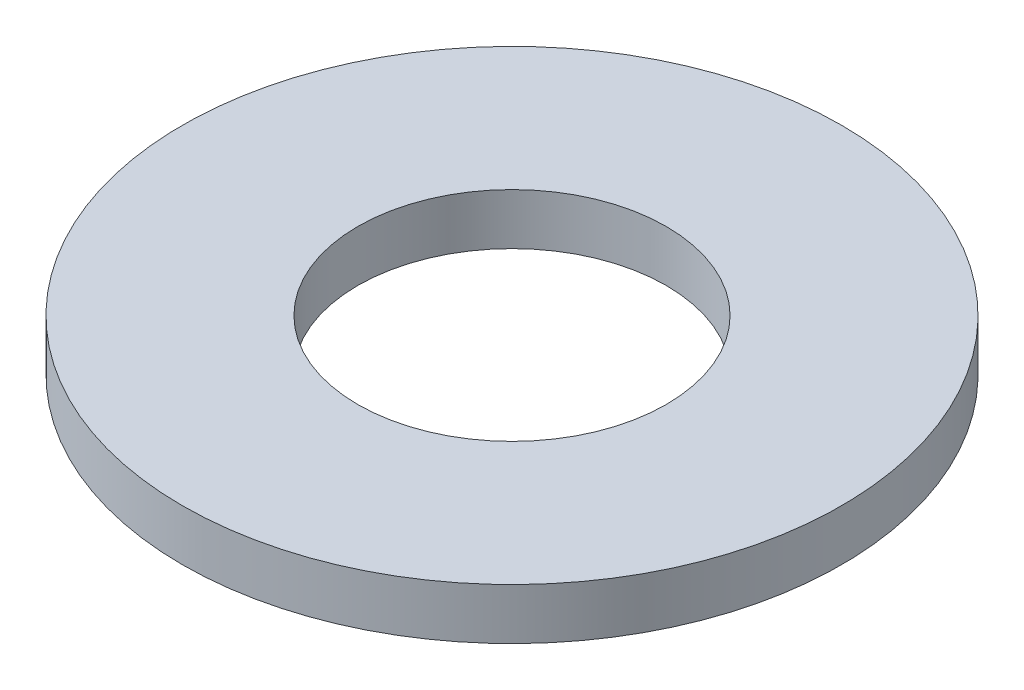
ISO-10303-21;
HEADER;
FILE_DESCRIPTION(('STEP AP214'),'2;1');
FILE_NAME('part.step','',(''),(''),'','','');
FILE_SCHEMA(('AUTOMOTIVE_DESIGN { 1 0 10303 214 1 1 1 1 }'));
ENDSEC;
DATA;
#1=APPLICATION_CONTEXT('core data for automotive mechanical design processes');
#2=APPLICATION_PROTOCOL_DEFINITION('international standard','automotive_design',2000,#1);
#3=PRODUCT_CONTEXT('',#1,'mechanical');
#4=PRODUCT('Part','Part','',(#3));
#5=PRODUCT_RELATED_PRODUCT_CATEGORY('part','',(#4));
#6=PRODUCT_DEFINITION_FORMATION('','',#4);
#7=PRODUCT_DEFINITION_CONTEXT('part definition',#1,'design');
#8=PRODUCT_DEFINITION('design','',#6,#7);
#9=PRODUCT_DEFINITION_SHAPE('','',#8);
#10=(LENGTH_UNIT() NAMED_UNIT(*) SI_UNIT(.MILLI.,.METRE.));
#11=(NAMED_UNIT(*) PLANE_ANGLE_UNIT() SI_UNIT($,.RADIAN.));
#12=(NAMED_UNIT(*) SI_UNIT($,.STERADIAN.) SOLID_ANGLE_UNIT());
#13=UNCERTAINTY_MEASURE_WITH_UNIT(LENGTH_MEASURE(1.E-05),#10,'distance_accuracy_value','');
#14=(GEOMETRIC_REPRESENTATION_CONTEXT(3) GLOBAL_UNCERTAINTY_ASSIGNED_CONTEXT((#13)) GLOBAL_UNIT_ASSIGNED_CONTEXT((#10,
#11,#12)) REPRESENTATION_CONTEXT('',''));
#15=CARTESIAN_POINT('',(0.,0.,0.));
#16=DIRECTION('',(0.,0.,1.));
#17=DIRECTION('',(1.,0.,0.));
#18=AXIS2_PLACEMENT_3D('',#15,#16,#17);
#19=CARTESIAN_POINT('',(0.,0.,0.));
#20=DIRECTION('',(0.,1.,0.));
#21=DIRECTION('',(0.,0.,1.));
#22=AXIS2_PLACEMENT_3D('',#19,#20,#21);
#23=PLANE('',#22);
#24=CARTESIAN_POINT('',(0.,0.,0.));
#25=DIRECTION('',(0.,-1.,0.));
#26=DIRECTION('',(0.,0.,-1.));
#27=AXIS2_PLACEMENT_3D('',#24,#25,#26);
#28=CIRCLE('',#27,4.826);
#29=CARTESIAN_POINT('',(0.,0.,-4.826));
#30=VERTEX_POINT('',#29);
#31=EDGE_CURVE('E27',#30,#30,#28,.F.);
#32=ORIENTED_EDGE('',*,*,#31,.T.);
#33=EDGE_LOOP('',(#32));
#34=FACE_BOUND('',#33,.T.);
#35=CARTESIAN_POINT('',(0.,0.,0.));
#36=DIRECTION('',(0.,-1.,0.));
#37=DIRECTION('',(0.,0.,-1.));
#38=AXIS2_PLACEMENT_3D('',#35,#36,#37);
#39=CIRCLE('',#38,10.3124);
#40=CARTESIAN_POINT('',(0.,0.,-10.3124));
#41=VERTEX_POINT('',#40);
#42=EDGE_CURVE('E18',#41,#41,#39,.F.);
#43=ORIENTED_EDGE('',*,*,#42,.F.);
#44=EDGE_LOOP('',(#43));
#45=FACE_BOUND('',#44,.T.);
#46=ADVANCED_FACE('F15',(#34,#45),#23,.F.);
#47=CARTESIAN_POINT('',(0.,1.6002,0.));
#48=DIRECTION('',(0.,-1.,0.));
#49=DIRECTION('',(0.,0.,-1.));
#50=AXIS2_PLACEMENT_3D('',#47,#48,#49);
#51=CYLINDRICAL_SURFACE('',#50,10.3124);
#52=ORIENTED_EDGE('',*,*,#42,.T.);
#53=EDGE_LOOP('',(#52));
#54=FACE_BOUND('',#53,.T.);
#55=CARTESIAN_POINT('',(0.,1.6002,0.));
#56=DIRECTION('',(0.,-1.,0.));
#57=DIRECTION('',(0.,0.,-1.));
#58=AXIS2_PLACEMENT_3D('',#55,#56,#57);
#59=CIRCLE('',#58,10.3124);
#60=CARTESIAN_POINT('',(0.,1.6002,-10.3124));
#61=VERTEX_POINT('',#60);
#62=EDGE_CURVE('E22',#61,#61,#59,.F.);
#63=ORIENTED_EDGE('',*,*,#62,.F.);
#64=EDGE_LOOP('',(#63));
#65=FACE_BOUND('',#64,.T.);
#66=ADVANCED_FACE('F35',(#54,#65),#51,.T.);
#67=CARTESIAN_POINT('',(0.,1.6002,0.));
#68=DIRECTION('',(0.,-1.,0.));
#69=DIRECTION('',(0.,0.,-1.));
#70=AXIS2_PLACEMENT_3D('',#67,#68,#69);
#71=CYLINDRICAL_SURFACE('',#70,4.826);
#72=CARTESIAN_POINT('',(0.,1.6002,0.));
#73=DIRECTION('',(0.,-1.,0.));
#74=DIRECTION('',(0.,0.,-1.));
#75=AXIS2_PLACEMENT_3D('',#72,#73,#74);
#76=CIRCLE('',#75,4.826);
#77=CARTESIAN_POINT('',(0.,1.6002,-4.826));
#78=VERTEX_POINT('',#77);
#79=EDGE_CURVE('E10',#78,#78,#76,.T.);
#80=ORIENTED_EDGE('',*,*,#79,.F.);
#81=EDGE_LOOP('',(#80));
#82=FACE_BOUND('',#81,.T.);
#83=ORIENTED_EDGE('',*,*,#31,.F.);
#84=EDGE_LOOP('',(#83));
#85=FACE_BOUND('',#84,.T.);
#86=ADVANCED_FACE('F43',(#82,#85),#71,.F.);
#87=CARTESIAN_POINT('',(0.,1.6002,0.));
#88=DIRECTION('',(0.,1.,0.));
#89=DIRECTION('',(0.,0.,1.));
#90=AXIS2_PLACEMENT_3D('',#87,#88,#89);
#91=PLANE('',#90);
#92=ORIENTED_EDGE('',*,*,#79,.T.);
#93=EDGE_LOOP('',(#92));
#94=FACE_BOUND('',#93,.T.);
#95=ORIENTED_EDGE('',*,*,#62,.T.);
#96=EDGE_LOOP('',(#95));
#97=FACE_BOUND('',#96,.T.);
#98=ADVANCED_FACE('F44',(#94,#97),#91,.T.);
#99=CLOSED_SHELL('',(#46,#66,#86,#98));
#100=MANIFOLD_SOLID_BREP('B1',#99);
#101=ADVANCED_BREP_SHAPE_REPRESENTATION('',(#18,#100),#14);
#102=SHAPE_DEFINITION_REPRESENTATION(#9,#101);
ENDSEC;
END-ISO-10303-21;
